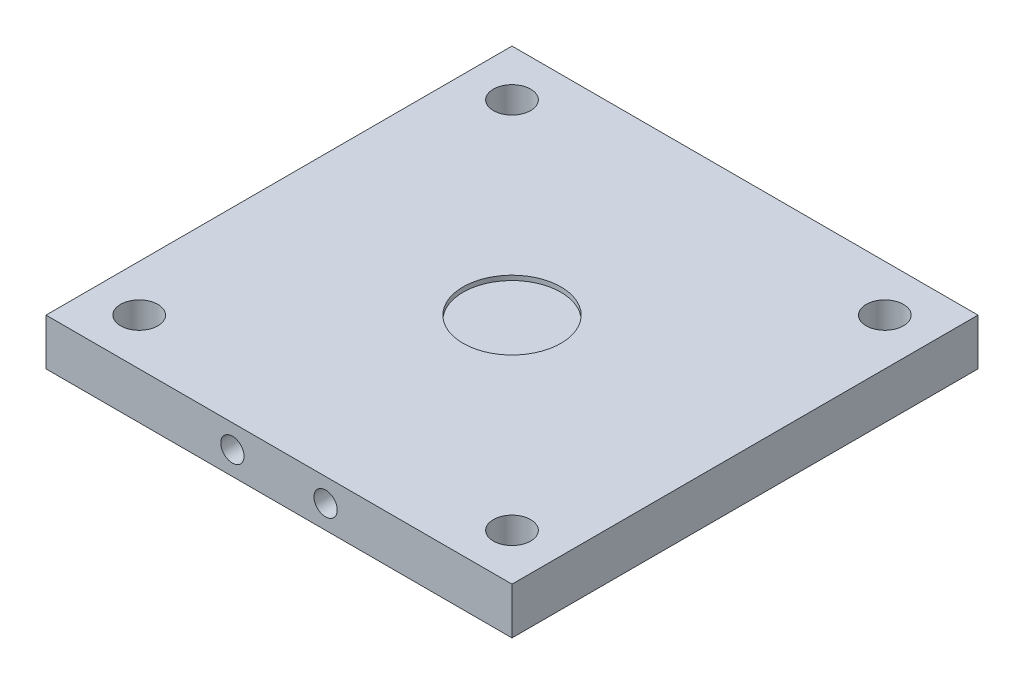
ISO-10303-21;
HEADER;
FILE_DESCRIPTION(('STEP AP214'),'2;1');
FILE_NAME('part.step','',(''),(''),'','','');
FILE_SCHEMA(('AUTOMOTIVE_DESIGN { 1 0 10303 214 1 1 1 1 }'));
ENDSEC;
DATA;
#1=APPLICATION_CONTEXT('core data for automotive mechanical design processes');
#2=APPLICATION_PROTOCOL_DEFINITION('international standard','automotive_design',2000,#1);
#3=PRODUCT_CONTEXT('',#1,'mechanical');
#4=PRODUCT('Part','Part','',(#3));
#5=PRODUCT_RELATED_PRODUCT_CATEGORY('part','',(#4));
#6=PRODUCT_DEFINITION_FORMATION('','',#4);
#7=PRODUCT_DEFINITION_CONTEXT('part definition',#1,'design');
#8=PRODUCT_DEFINITION('design','',#6,#7);
#9=PRODUCT_DEFINITION_SHAPE('','',#8);
#10=(LENGTH_UNIT() NAMED_UNIT(*) SI_UNIT(.MILLI.,.METRE.));
#11=(NAMED_UNIT(*) PLANE_ANGLE_UNIT() SI_UNIT($,.RADIAN.));
#12=(NAMED_UNIT(*) SI_UNIT($,.STERADIAN.) SOLID_ANGLE_UNIT());
#13=UNCERTAINTY_MEASURE_WITH_UNIT(LENGTH_MEASURE(1.E-05),#10,'distance_accuracy_value','');
#14=(GEOMETRIC_REPRESENTATION_CONTEXT(3) GLOBAL_UNCERTAINTY_ASSIGNED_CONTEXT((#13)) GLOBAL_UNIT_ASSIGNED_CONTEXT((#10,
#11,#12)) REPRESENTATION_CONTEXT('',''));
#15=CARTESIAN_POINT('',(0.,0.,0.));
#16=DIRECTION('',(0.,0.,1.));
#17=DIRECTION('',(1.,0.,0.));
#18=AXIS2_PLACEMENT_3D('',#15,#16,#17);
#19=CARTESIAN_POINT('',(-50.,10.,-50.));
#20=DIRECTION('',(1.,0.,0.));
#21=DIRECTION('',(0.,0.,-1.));
#22=AXIS2_PLACEMENT_3D('',#19,#20,#21);
#23=PLANE('',#22);
#24=DIRECTION('',(0.,0.,1.));
#25=VECTOR('',#24,1.);
#26=CARTESIAN_POINT('',(-50.,0.,-50.));
#27=LINE('',#26,#25);
#28=CARTESIAN_POINT('',(-50.,0.,-50.));
#29=VERTEX_POINT('',#28);
#30=CARTESIAN_POINT('',(-50.,0.,50.));
#31=VERTEX_POINT('',#30);
#32=EDGE_CURVE('E109',#29,#31,#27,.T.);
#33=ORIENTED_EDGE('',*,*,#32,.T.);
#34=DIRECTION('',(0.,-1.,0.));
#35=VECTOR('',#34,1.);
#36=CARTESIAN_POINT('',(-50.,10.,50.));
#37=LINE('',#36,#35);
#38=CARTESIAN_POINT('',(-50.,10.,50.));
#39=VERTEX_POINT('',#38);
#40=EDGE_CURVE('E11',#39,#31,#37,.T.);
#41=ORIENTED_EDGE('',*,*,#40,.F.);
#42=DIRECTION('',(0.,0.,1.));
#43=VECTOR('',#42,1.);
#44=CARTESIAN_POINT('',(-50.,10.,-50.));
#45=LINE('',#44,#43);
#46=CARTESIAN_POINT('',(-50.,10.,-50.));
#47=VERTEX_POINT('',#46);
#48=EDGE_CURVE('E93',#47,#39,#45,.T.);
#49=ORIENTED_EDGE('',*,*,#48,.F.);
#50=DIRECTION('',(0.,-1.,0.));
#51=VECTOR('',#50,1.);
#52=CARTESIAN_POINT('',(-50.,10.,-50.));
#53=LINE('',#52,#51);
#54=EDGE_CURVE('E105',#47,#29,#53,.T.);
#55=ORIENTED_EDGE('',*,*,#54,.T.);
#56=EDGE_LOOP('',(#33,#41,#49,#55));
#57=FACE_BOUND('',#56,.T.);
#58=ADVANCED_FACE('F41',(#57),#23,.F.);
#59=CARTESIAN_POINT('',(50.,10.,50.));
#60=DIRECTION('',(0.,0.,-1.));
#61=DIRECTION('',(-1.,0.,0.));
#62=AXIS2_PLACEMENT_3D('',#59,#60,#61);
#63=PLANE('',#62);
#64=CARTESIAN_POINT('',(9.99999999999999,5.00000000000001,50.));
#65=DIRECTION('',(0.,0.,-1.));
#66=DIRECTION('',(-1.,0.,0.));
#67=AXIS2_PLACEMENT_3D('',#64,#65,#66);
#68=CIRCLE('',#67,2.5);
#69=CARTESIAN_POINT('',(7.49999999999999,5.00000000000001,50.));
#70=VERTEX_POINT('',#69);
#71=EDGE_CURVE('E163',#70,#70,#68,.T.);
#72=ORIENTED_EDGE('',*,*,#71,.T.);
#73=EDGE_LOOP('',(#72));
#74=FACE_BOUND('',#73,.T.);
#75=CARTESIAN_POINT('',(-10.,5.00000000000001,50.));
#76=DIRECTION('',(0.,0.,-1.));
#77=DIRECTION('',(-1.,0.,0.));
#78=AXIS2_PLACEMENT_3D('',#75,#76,#77);
#79=CIRCLE('',#78,2.5);
#80=CARTESIAN_POINT('',(-12.5,5.00000000000001,50.));
#81=VERTEX_POINT('',#80);
#82=EDGE_CURVE('E154',#81,#81,#79,.T.);
#83=ORIENTED_EDGE('',*,*,#82,.T.);
#84=EDGE_LOOP('',(#83));
#85=FACE_BOUND('',#84,.T.);
#86=DIRECTION('',(1.,0.,0.));
#87=VECTOR('',#86,1.);
#88=CARTESIAN_POINT('',(50.,0.,50.));
#89=LINE('',#88,#87);
#90=CARTESIAN_POINT('',(50.,0.,50.));
#91=VERTEX_POINT('',#90);
#92=EDGE_CURVE('E98',#31,#91,#89,.T.);
#93=ORIENTED_EDGE('',*,*,#92,.T.);
#94=DIRECTION('',(0.,-1.,0.));
#95=VECTOR('',#94,1.);
#96=CARTESIAN_POINT('',(50.,10.,50.));
#97=LINE('',#96,#95);
#98=CARTESIAN_POINT('',(50.,10.,50.));
#99=VERTEX_POINT('',#98);
#100=EDGE_CURVE('E50',#99,#91,#97,.T.);
#101=ORIENTED_EDGE('',*,*,#100,.F.);
#102=DIRECTION('',(1.,0.,0.));
#103=VECTOR('',#102,1.);
#104=CARTESIAN_POINT('',(50.,10.,50.));
#105=LINE('',#104,#103);
#106=EDGE_CURVE('E88',#39,#99,#105,.T.);
#107=ORIENTED_EDGE('',*,*,#106,.F.);
#108=ORIENTED_EDGE('',*,*,#40,.T.);
#109=EDGE_LOOP('',(#93,#101,#107,#108));
#110=FACE_BOUND('',#109,.T.);
#111=ADVANCED_FACE('F97',(#74,#85,#110),#63,.F.);
#112=CARTESIAN_POINT('',(50.,10.,-50.));
#113=DIRECTION('',(-1.,0.,0.));
#114=DIRECTION('',(0.,0.,1.));
#115=AXIS2_PLACEMENT_3D('',#112,#113,#114);
#116=PLANE('',#115);
#117=DIRECTION('',(0.,0.,-1.));
#118=VECTOR('',#117,1.);
#119=CARTESIAN_POINT('',(50.,0.,-50.));
#120=LINE('',#119,#118);
#121=CARTESIAN_POINT('',(50.,0.,-50.));
#122=VERTEX_POINT('',#121);
#123=EDGE_CURVE('E75',#91,#122,#120,.T.);
#124=ORIENTED_EDGE('',*,*,#123,.T.);
#125=DIRECTION('',(0.,-1.,0.));
#126=VECTOR('',#125,1.);
#127=CARTESIAN_POINT('',(50.,10.,-50.));
#128=LINE('',#127,#126);
#129=CARTESIAN_POINT('',(50.,10.,-50.));
#130=VERTEX_POINT('',#129);
#131=EDGE_CURVE('E100',#130,#122,#128,.T.);
#132=ORIENTED_EDGE('',*,*,#131,.F.);
#133=DIRECTION('',(0.,0.,-1.));
#134=VECTOR('',#133,1.);
#135=CARTESIAN_POINT('',(50.,10.,-50.));
#136=LINE('',#135,#134);
#137=EDGE_CURVE('E91',#99,#130,#136,.T.);
#138=ORIENTED_EDGE('',*,*,#137,.F.);
#139=ORIENTED_EDGE('',*,*,#100,.T.);
#140=EDGE_LOOP('',(#124,#132,#138,#139));
#141=FACE_BOUND('',#140,.T.);
#142=ADVANCED_FACE('F101',(#141),#116,.F.);
#143=CARTESIAN_POINT('',(50.,10.,-50.));
#144=DIRECTION('',(0.,0.,1.));
#145=DIRECTION('',(1.,0.,0.));
#146=AXIS2_PLACEMENT_3D('',#143,#144,#145);
#147=PLANE('',#146);
#148=CARTESIAN_POINT('',(9.99999999999999,5.00000000000001,-50.));
#149=DIRECTION('',(0.,0.,-1.));
#150=DIRECTION('',(-1.,0.,0.));
#151=AXIS2_PLACEMENT_3D('',#148,#149,#150);
#152=CIRCLE('',#151,2.5);
#153=CARTESIAN_POINT('',(7.49999999999999,5.00000000000001,-50.));
#154=VERTEX_POINT('',#153);
#155=EDGE_CURVE('E147',#154,#154,#152,.T.);
#156=ORIENTED_EDGE('',*,*,#155,.F.);
#157=EDGE_LOOP('',(#156));
#158=FACE_BOUND('',#157,.T.);
#159=CARTESIAN_POINT('',(-10.,5.00000000000001,-50.));
#160=DIRECTION('',(0.,0.,-1.));
#161=DIRECTION('',(-1.,0.,0.));
#162=AXIS2_PLACEMENT_3D('',#159,#160,#161);
#163=CIRCLE('',#162,2.5);
#164=CARTESIAN_POINT('',(-12.5,5.00000000000001,-50.));
#165=VERTEX_POINT('',#164);
#166=EDGE_CURVE('E138',#165,#165,#163,.T.);
#167=ORIENTED_EDGE('',*,*,#166,.F.);
#168=EDGE_LOOP('',(#167));
#169=FACE_BOUND('',#168,.T.);
#170=DIRECTION('',(-1.,0.,0.));
#171=VECTOR('',#170,1.);
#172=CARTESIAN_POINT('',(50.,0.,-50.));
#173=LINE('',#172,#171);
#174=EDGE_CURVE('E81',#122,#29,#173,.T.);
#175=ORIENTED_EDGE('',*,*,#174,.T.);
#176=ORIENTED_EDGE('',*,*,#54,.F.);
#177=DIRECTION('',(-1.,0.,0.));
#178=VECTOR('',#177,1.);
#179=CARTESIAN_POINT('',(50.,10.,-50.));
#180=LINE('',#179,#178);
#181=EDGE_CURVE('E58',#130,#47,#180,.T.);
#182=ORIENTED_EDGE('',*,*,#181,.F.);
#183=ORIENTED_EDGE('',*,*,#131,.T.);
#184=EDGE_LOOP('',(#175,#176,#182,#183));
#185=FACE_BOUND('',#184,.T.);
#186=ADVANCED_FACE('F123',(#158,#169,#185),#147,.F.);
#187=CARTESIAN_POINT('',(0.,10.,0.));
#188=DIRECTION('',(0.,-1.,0.));
#189=DIRECTION('',(0.,0.,-1.));
#190=AXIS2_PLACEMENT_3D('',#187,#188,#189);
#191=PLANE('',#190);
#192=CARTESIAN_POINT('',(40.,10.,-40.));
#193=DIRECTION('',(0.,1.,0.));
#194=DIRECTION('',(0.,0.,1.));
#195=AXIS2_PLACEMENT_3D('',#192,#193,#194);
#196=CIRCLE('',#195,4.);
#197=CARTESIAN_POINT('',(40.,10.,-36.));
#198=VERTEX_POINT('',#197);
#199=EDGE_CURVE('E178',#198,#198,#196,.T.);
#200=ORIENTED_EDGE('',*,*,#199,.F.);
#201=EDGE_LOOP('',(#200));
#202=FACE_BOUND('',#201,.T.);
#203=CARTESIAN_POINT('',(-40.,10.,-40.));
#204=DIRECTION('',(0.,1.,0.));
#205=DIRECTION('',(0.,0.,1.));
#206=AXIS2_PLACEMENT_3D('',#203,#204,#205);
#207=CIRCLE('',#206,4.00000000000001);
#208=CARTESIAN_POINT('',(-40.,10.,-36.));
#209=VERTEX_POINT('',#208);
#210=EDGE_CURVE('E186',#209,#209,#207,.T.);
#211=ORIENTED_EDGE('',*,*,#210,.F.);
#212=EDGE_LOOP('',(#211));
#213=FACE_BOUND('',#212,.T.);
#214=CARTESIAN_POINT('',(-40.,10.,40.));
#215=DIRECTION('',(0.,1.,0.));
#216=DIRECTION('',(0.,0.,1.));
#217=AXIS2_PLACEMENT_3D('',#214,#215,#216);
#218=CIRCLE('',#217,4.);
#219=CARTESIAN_POINT('',(-40.,10.,44.));
#220=VERTEX_POINT('',#219);
#221=EDGE_CURVE('E194',#220,#220,#218,.T.);
#222=ORIENTED_EDGE('',*,*,#221,.F.);
#223=EDGE_LOOP('',(#222));
#224=FACE_BOUND('',#223,.T.);
#225=CARTESIAN_POINT('',(40.,10.,40.));
#226=DIRECTION('',(0.,1.,0.));
#227=DIRECTION('',(0.,0.,1.));
#228=AXIS2_PLACEMENT_3D('',#225,#226,#227);
#229=CIRCLE('',#228,4.);
#230=CARTESIAN_POINT('',(40.,10.,44.));
#231=VERTEX_POINT('',#230);
#232=EDGE_CURVE('E170',#231,#231,#229,.T.);
#233=ORIENTED_EDGE('',*,*,#232,.F.);
#234=EDGE_LOOP('',(#233));
#235=FACE_BOUND('',#234,.T.);
#236=CARTESIAN_POINT('',(0.,10.,0.));
#237=DIRECTION('',(0.,1.,0.));
#238=DIRECTION('',(0.,0.,1.));
#239=AXIS2_PLACEMENT_3D('',#236,#237,#238);
#240=CIRCLE('',#239,10.5);
#241=CARTESIAN_POINT('',(0.,10.,10.5));
#242=VERTEX_POINT('',#241);
#243=EDGE_CURVE('E130',#242,#242,#240,.T.);
#244=ORIENTED_EDGE('',*,*,#243,.F.);
#245=EDGE_LOOP('',(#244));
#246=FACE_BOUND('',#245,.T.);
#247=ORIENTED_EDGE('',*,*,#48,.T.);
#248=ORIENTED_EDGE('',*,*,#106,.T.);
#249=ORIENTED_EDGE('',*,*,#137,.T.);
#250=ORIENTED_EDGE('',*,*,#181,.T.);
#251=EDGE_LOOP('',(#247,#248,#249,#250));
#252=FACE_BOUND('',#251,.T.);
#253=ADVANCED_FACE('F89',(#202,#213,#224,#235,#246,#252),#191,.F.);
#254=CARTESIAN_POINT('',(0.,0.,0.));
#255=DIRECTION('',(0.,-1.,0.));
#256=DIRECTION('',(0.,0.,-1.));
#257=AXIS2_PLACEMENT_3D('',#254,#255,#256);
#258=PLANE('',#257);
#259=CARTESIAN_POINT('',(40.,0.,-40.));
#260=DIRECTION('',(0.,1.,0.));
#261=DIRECTION('',(0.,0.,1.));
#262=AXIS2_PLACEMENT_3D('',#259,#260,#261);
#263=CIRCLE('',#262,4.);
#264=CARTESIAN_POINT('',(40.,0.,-36.));
#265=VERTEX_POINT('',#264);
#266=EDGE_CURVE('E182',#265,#265,#263,.T.);
#267=ORIENTED_EDGE('',*,*,#266,.T.);
#268=EDGE_LOOP('',(#267));
#269=FACE_BOUND('',#268,.T.);
#270=CARTESIAN_POINT('',(-40.,0.,-40.));
#271=DIRECTION('',(0.,1.,0.));
#272=DIRECTION('',(0.,0.,1.));
#273=AXIS2_PLACEMENT_3D('',#270,#271,#272);
#274=CIRCLE('',#273,4.00000000000001);
#275=CARTESIAN_POINT('',(-40.,0.,-36.));
#276=VERTEX_POINT('',#275);
#277=EDGE_CURVE('E190',#276,#276,#274,.T.);
#278=ORIENTED_EDGE('',*,*,#277,.T.);
#279=EDGE_LOOP('',(#278));
#280=FACE_BOUND('',#279,.T.);
#281=CARTESIAN_POINT('',(-40.,0.,40.));
#282=DIRECTION('',(0.,1.,0.));
#283=DIRECTION('',(0.,0.,1.));
#284=AXIS2_PLACEMENT_3D('',#281,#282,#283);
#285=CIRCLE('',#284,4.);
#286=CARTESIAN_POINT('',(-40.,0.,44.));
#287=VERTEX_POINT('',#286);
#288=EDGE_CURVE('E174',#287,#287,#285,.T.);
#289=ORIENTED_EDGE('',*,*,#288,.T.);
#290=EDGE_LOOP('',(#289));
#291=FACE_BOUND('',#290,.T.);
#292=CARTESIAN_POINT('',(40.,0.,40.));
#293=DIRECTION('',(0.,1.,0.));
#294=DIRECTION('',(0.,0.,1.));
#295=AXIS2_PLACEMENT_3D('',#292,#293,#294);
#296=CIRCLE('',#295,4.);
#297=CARTESIAN_POINT('',(40.,0.,44.));
#298=VERTEX_POINT('',#297);
#299=EDGE_CURVE('E159',#298,#298,#296,.T.);
#300=ORIENTED_EDGE('',*,*,#299,.T.);
#301=EDGE_LOOP('',(#300));
#302=FACE_BOUND('',#301,.T.);
#303=ORIENTED_EDGE('',*,*,#32,.F.);
#304=ORIENTED_EDGE('',*,*,#174,.F.);
#305=ORIENTED_EDGE('',*,*,#123,.F.);
#306=ORIENTED_EDGE('',*,*,#92,.F.);
#307=EDGE_LOOP('',(#303,#304,#305,#306));
#308=FACE_BOUND('',#307,.T.);
#309=ADVANCED_FACE('F126',(#269,#280,#291,#302,#308),#258,.T.);
#310=CARTESIAN_POINT('',(0.,9.,0.));
#311=DIRECTION('',(0.,1.,0.));
#312=DIRECTION('',(0.,0.,1.));
#313=AXIS2_PLACEMENT_3D('',#310,#311,#312);
#314=CYLINDRICAL_SURFACE('',#313,10.5);
#315=CARTESIAN_POINT('',(0.,9.,0.));
#316=DIRECTION('',(0.,1.,0.));
#317=DIRECTION('',(0.,0.,1.));
#318=AXIS2_PLACEMENT_3D('',#315,#316,#317);
#319=CIRCLE('',#318,10.5);
#320=CARTESIAN_POINT('',(0.,9.,10.5));
#321=VERTEX_POINT('',#320);
#322=EDGE_CURVE('E113',#321,#321,#319,.T.);
#323=ORIENTED_EDGE('',*,*,#322,.F.);
#324=EDGE_LOOP('',(#323));
#325=FACE_BOUND('',#324,.T.);
#326=ORIENTED_EDGE('',*,*,#243,.T.);
#327=EDGE_LOOP('',(#326));
#328=FACE_BOUND('',#327,.T.);
#329=ADVANCED_FACE('F220',(#325,#328),#314,.F.);
#330=CARTESIAN_POINT('',(0.,9.,0.));
#331=DIRECTION('',(0.,1.,0.));
#332=DIRECTION('',(0.,0.,1.));
#333=AXIS2_PLACEMENT_3D('',#330,#331,#332);
#334=PLANE('',#333);
#335=ORIENTED_EDGE('',*,*,#322,.T.);
#336=EDGE_LOOP('',(#335));
#337=FACE_BOUND('',#336,.T.);
#338=ADVANCED_FACE('F222',(#337),#334,.T.);
#339=CARTESIAN_POINT('',(-10.,5.00000000000001,-40.));
#340=DIRECTION('',(0.,0.,-1.));
#341=DIRECTION('',(-1.,0.,0.));
#342=AXIS2_PLACEMENT_3D('',#339,#340,#341);
#343=CYLINDRICAL_SURFACE('',#342,2.5);
#344=CARTESIAN_POINT('',(-10.,5.00000000000001,-40.));
#345=DIRECTION('',(0.,0.,-1.));
#346=DIRECTION('',(-1.,0.,0.));
#347=AXIS2_PLACEMENT_3D('',#344,#345,#346);
#348=CIRCLE('',#347,2.5);
#349=CARTESIAN_POINT('',(-12.5,5.00000000000001,-40.));
#350=VERTEX_POINT('',#349);
#351=EDGE_CURVE('E142',#350,#350,#348,.T.);
#352=ORIENTED_EDGE('',*,*,#351,.F.);
#353=EDGE_LOOP('',(#352));
#354=FACE_BOUND('',#353,.T.);
#355=ORIENTED_EDGE('',*,*,#166,.T.);
#356=EDGE_LOOP('',(#355));
#357=FACE_BOUND('',#356,.T.);
#358=ADVANCED_FACE('F229',(#354,#357),#343,.F.);
#359=CARTESIAN_POINT('',(-10.,5.00000000000001,-40.));
#360=DIRECTION('',(0.,0.,-1.));
#361=DIRECTION('',(-1.,0.,0.));
#362=AXIS2_PLACEMENT_3D('',#359,#360,#361);
#363=PLANE('',#362);
#364=ORIENTED_EDGE('',*,*,#351,.T.);
#365=EDGE_LOOP('',(#364));
#366=FACE_BOUND('',#365,.T.);
#367=ADVANCED_FACE('F255',(#366),#363,.T.);
#368=CARTESIAN_POINT('',(9.99999999999999,5.00000000000001,-40.));
#369=DIRECTION('',(0.,0.,-1.));
#370=DIRECTION('',(-1.,0.,0.));
#371=AXIS2_PLACEMENT_3D('',#368,#369,#370);
#372=CYLINDRICAL_SURFACE('',#371,2.5);
#373=CARTESIAN_POINT('',(9.99999999999999,5.00000000000001,-40.));
#374=DIRECTION('',(0.,0.,-1.));
#375=DIRECTION('',(-1.,0.,0.));
#376=AXIS2_PLACEMENT_3D('',#373,#374,#375);
#377=CIRCLE('',#376,2.5);
#378=CARTESIAN_POINT('',(7.49999999999999,5.00000000000001,-40.));
#379=VERTEX_POINT('',#378);
#380=EDGE_CURVE('E134',#379,#379,#377,.T.);
#381=ORIENTED_EDGE('',*,*,#380,.F.);
#382=EDGE_LOOP('',(#381));
#383=FACE_BOUND('',#382,.T.);
#384=ORIENTED_EDGE('',*,*,#155,.T.);
#385=EDGE_LOOP('',(#384));
#386=FACE_BOUND('',#385,.T.);
#387=ADVANCED_FACE('F261',(#383,#386),#372,.F.);
#388=CARTESIAN_POINT('',(9.99999999999999,5.00000000000001,-40.));
#389=DIRECTION('',(0.,0.,-1.));
#390=DIRECTION('',(-1.,0.,0.));
#391=AXIS2_PLACEMENT_3D('',#388,#389,#390);
#392=PLANE('',#391);
#393=ORIENTED_EDGE('',*,*,#380,.T.);
#394=EDGE_LOOP('',(#393));
#395=FACE_BOUND('',#394,.T.);
#396=ADVANCED_FACE('F268',(#395),#392,.T.);
#397=CARTESIAN_POINT('',(-10.,5.00000000000001,40.));
#398=DIRECTION('',(0.,0.,1.));
#399=DIRECTION('',(1.,0.,0.));
#400=AXIS2_PLACEMENT_3D('',#397,#398,#399);
#401=CYLINDRICAL_SURFACE('',#400,2.5);
#402=CARTESIAN_POINT('',(-10.,5.00000000000001,40.));
#403=DIRECTION('',(0.,0.,-1.));
#404=DIRECTION('',(-1.,0.,0.));
#405=AXIS2_PLACEMENT_3D('',#402,#403,#404);
#406=CIRCLE('',#405,2.5);
#407=CARTESIAN_POINT('',(-12.5,5.00000000000001,40.));
#408=VERTEX_POINT('',#407);
#409=EDGE_CURVE('E158',#408,#408,#406,.T.);
#410=ORIENTED_EDGE('',*,*,#409,.T.);
#411=EDGE_LOOP('',(#410));
#412=FACE_BOUND('',#411,.T.);
#413=ORIENTED_EDGE('',*,*,#82,.F.);
#414=EDGE_LOOP('',(#413));
#415=FACE_BOUND('',#414,.T.);
#416=ADVANCED_FACE('F272',(#412,#415),#401,.F.);
#417=CARTESIAN_POINT('',(-10.,5.00000000000001,40.));
#418=DIRECTION('',(0.,0.,1.));
#419=DIRECTION('',(-1.,0.,0.));
#420=AXIS2_PLACEMENT_3D('',#417,#418,#419);
#421=PLANE('',#420);
#422=ORIENTED_EDGE('',*,*,#409,.F.);
#423=EDGE_LOOP('',(#422));
#424=FACE_BOUND('',#423,.T.);
#425=ADVANCED_FACE('F276',(#424),#421,.T.);
#426=CARTESIAN_POINT('',(9.99999999999999,5.00000000000001,40.));
#427=DIRECTION('',(0.,0.,1.));
#428=DIRECTION('',(1.,0.,0.));
#429=AXIS2_PLACEMENT_3D('',#426,#427,#428);
#430=CYLINDRICAL_SURFACE('',#429,2.5);
#431=CARTESIAN_POINT('',(9.99999999999999,5.00000000000001,40.));
#432=DIRECTION('',(0.,0.,-1.));
#433=DIRECTION('',(-1.,0.,0.));
#434=AXIS2_PLACEMENT_3D('',#431,#432,#433);
#435=CIRCLE('',#434,2.5);
#436=CARTESIAN_POINT('',(7.49999999999999,5.00000000000001,40.));
#437=VERTEX_POINT('',#436);
#438=EDGE_CURVE('E143',#437,#437,#435,.T.);
#439=ORIENTED_EDGE('',*,*,#438,.T.);
#440=EDGE_LOOP('',(#439));
#441=FACE_BOUND('',#440,.T.);
#442=ORIENTED_EDGE('',*,*,#71,.F.);
#443=EDGE_LOOP('',(#442));
#444=FACE_BOUND('',#443,.T.);
#445=ADVANCED_FACE('F280',(#441,#444),#430,.F.);
#446=CARTESIAN_POINT('',(9.99999999999999,5.00000000000001,40.));
#447=DIRECTION('',(0.,0.,1.));
#448=DIRECTION('',(-1.,0.,0.));
#449=AXIS2_PLACEMENT_3D('',#446,#447,#448);
#450=PLANE('',#449);
#451=ORIENTED_EDGE('',*,*,#438,.F.);
#452=EDGE_LOOP('',(#451));
#453=FACE_BOUND('',#452,.T.);
#454=ADVANCED_FACE('F284',(#453),#450,.T.);
#455=CARTESIAN_POINT('',(40.,0.,40.));
#456=DIRECTION('',(0.,1.,0.));
#457=DIRECTION('',(0.,0.,1.));
#458=AXIS2_PLACEMENT_3D('',#455,#456,#457);
#459=CYLINDRICAL_SURFACE('',#458,4.);
#460=ORIENTED_EDGE('',*,*,#299,.F.);
#461=EDGE_LOOP('',(#460));
#462=FACE_BOUND('',#461,.T.);
#463=ORIENTED_EDGE('',*,*,#232,.T.);
#464=EDGE_LOOP('',(#463));
#465=FACE_BOUND('',#464,.T.);
#466=ADVANCED_FACE('F208',(#462,#465),#459,.F.);
#467=CARTESIAN_POINT('',(-40.,0.,40.));
#468=DIRECTION('',(0.,1.,0.));
#469=DIRECTION('',(0.,0.,1.));
#470=AXIS2_PLACEMENT_3D('',#467,#468,#469);
#471=CYLINDRICAL_SURFACE('',#470,4.);
#472=ORIENTED_EDGE('',*,*,#288,.F.);
#473=EDGE_LOOP('',(#472));
#474=FACE_BOUND('',#473,.T.);
#475=ORIENTED_EDGE('',*,*,#221,.T.);
#476=EDGE_LOOP('',(#475));
#477=FACE_BOUND('',#476,.T.);
#478=ADVANCED_FACE('F204',(#474,#477),#471,.F.);
#479=CARTESIAN_POINT('',(-40.,0.,-40.));
#480=DIRECTION('',(0.,1.,0.));
#481=DIRECTION('',(0.,0.,1.));
#482=AXIS2_PLACEMENT_3D('',#479,#480,#481);
#483=CYLINDRICAL_SURFACE('',#482,4.00000000000001);
#484=ORIENTED_EDGE('',*,*,#277,.F.);
#485=EDGE_LOOP('',(#484));
#486=FACE_BOUND('',#485,.T.);
#487=ORIENTED_EDGE('',*,*,#210,.T.);
#488=EDGE_LOOP('',(#487));
#489=FACE_BOUND('',#488,.T.);
#490=ADVANCED_FACE('F207',(#486,#489),#483,.F.);
#491=CARTESIAN_POINT('',(40.,0.,-40.));
#492=DIRECTION('',(0.,1.,0.));
#493=DIRECTION('',(0.,0.,1.));
#494=AXIS2_PLACEMENT_3D('',#491,#492,#493);
#495=CYLINDRICAL_SURFACE('',#494,4.);
#496=ORIENTED_EDGE('',*,*,#266,.F.);
#497=EDGE_LOOP('',(#496));
#498=FACE_BOUND('',#497,.T.);
#499=ORIENTED_EDGE('',*,*,#199,.T.);
#500=EDGE_LOOP('',(#499));
#501=FACE_BOUND('',#500,.T.);
#502=ADVANCED_FACE('F292',(#498,#501),#495,.F.);
#503=CLOSED_SHELL('',(#58,#111,#142,#186,#253,#309,#329,#338,#358,#367,#387,#396,#416,#425,#445,
#454,#466,#478,#490,#502));
#504=MANIFOLD_SOLID_BREP('B2',#503);
#505=ADVANCED_BREP_SHAPE_REPRESENTATION('',(#18,#504),#14);
#506=SHAPE_DEFINITION_REPRESENTATION(#9,#505);
ENDSEC;
END-ISO-10303-21;
